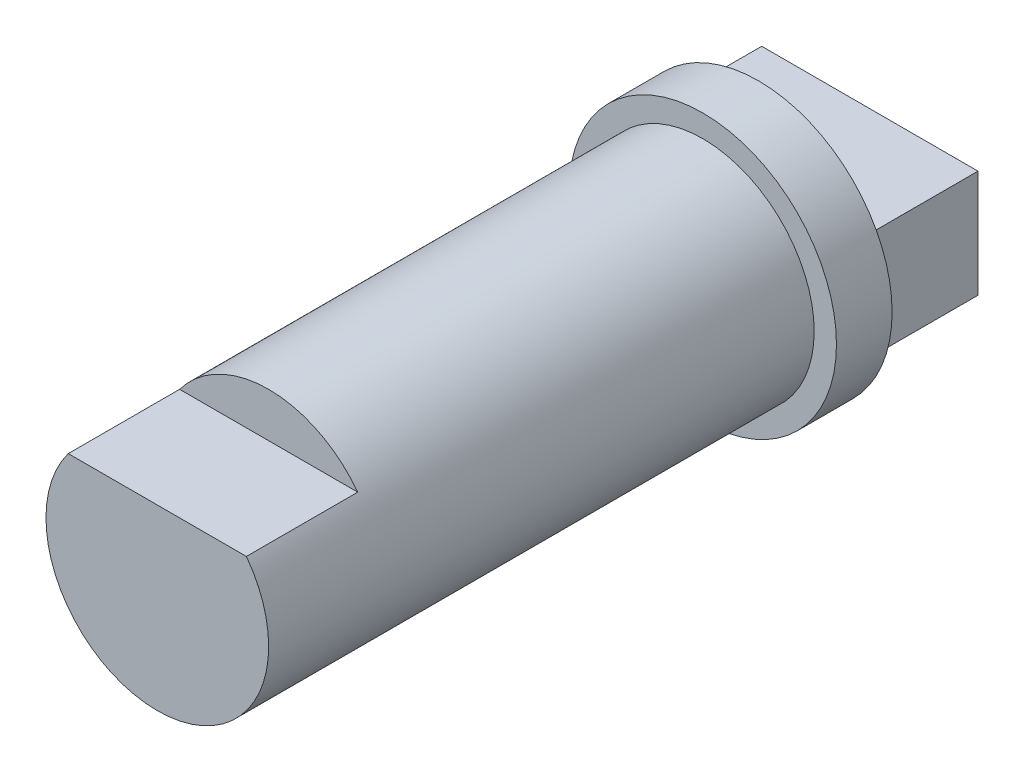
ISO-10303-21;
HEADER;
FILE_DESCRIPTION(('STEP AP214'),'2;1');
FILE_NAME('part.step','',(''),(''),'','','');
FILE_SCHEMA(('AUTOMOTIVE_DESIGN { 1 0 10303 214 1 1 1 1 }'));
ENDSEC;
DATA;
#1=APPLICATION_CONTEXT('core data for automotive mechanical design processes');
#2=APPLICATION_PROTOCOL_DEFINITION('international standard','automotive_design',2000,#1);
#3=PRODUCT_CONTEXT('',#1,'mechanical');
#4=PRODUCT('Part','Part','',(#3));
#5=PRODUCT_RELATED_PRODUCT_CATEGORY('part','',(#4));
#6=PRODUCT_DEFINITION_FORMATION('','',#4);
#7=PRODUCT_DEFINITION_CONTEXT('part definition',#1,'design');
#8=PRODUCT_DEFINITION('design','',#6,#7);
#9=PRODUCT_DEFINITION_SHAPE('','',#8);
#10=(LENGTH_UNIT() NAMED_UNIT(*) SI_UNIT(.MILLI.,.METRE.));
#11=(NAMED_UNIT(*) PLANE_ANGLE_UNIT() SI_UNIT($,.RADIAN.));
#12=(NAMED_UNIT(*) SI_UNIT($,.STERADIAN.) SOLID_ANGLE_UNIT());
#13=UNCERTAINTY_MEASURE_WITH_UNIT(LENGTH_MEASURE(1.E-05),#10,'distance_accuracy_value','');
#14=(GEOMETRIC_REPRESENTATION_CONTEXT(3) GLOBAL_UNCERTAINTY_ASSIGNED_CONTEXT((#13)) GLOBAL_UNIT_ASSIGNED_CONTEXT((#10,
#11,#12)) REPRESENTATION_CONTEXT('',''));
#15=CARTESIAN_POINT('',(0.,0.,0.));
#16=DIRECTION('',(0.,0.,1.));
#17=DIRECTION('',(1.,0.,0.));
#18=AXIS2_PLACEMENT_3D('',#15,#16,#17);
#19=CARTESIAN_POINT('',(0.,0.,49.));
#20=DIRECTION('',(0.,0.,-1.));
#21=DIRECTION('',(-1.,0.,0.));
#22=AXIS2_PLACEMENT_3D('',#19,#20,#21);
#23=CYLINDRICAL_SURFACE('',#22,10.);
#24=CARTESIAN_POINT('',(0.,0.,0.));
#25=DIRECTION('',(0.,0.,1.));
#26=DIRECTION('',(1.,0.,0.));
#27=AXIS2_PLACEMENT_3D('',#24,#25,#26);
#28=CIRCLE('',#27,10.);
#29=CARTESIAN_POINT('',(10.,0.,0.));
#30=VERTEX_POINT('',#29);
#31=EDGE_CURVE('E42',#30,#30,#28,.T.);
#32=ORIENTED_EDGE('',*,*,#31,.T.);
#33=EDGE_LOOP('',(#32));
#34=FACE_BOUND('',#33,.T.);
#35=DIRECTION('',(0.,0.,1.));
#36=VECTOR('',#35,1.);
#37=CARTESIAN_POINT('',(8.,6.,39.));
#38=LINE('',#37,#36);
#39=CARTESIAN_POINT('',(8.,6.,39.));
#40=VERTEX_POINT('',#39);
#41=CARTESIAN_POINT('',(8.,6.,49.));
#42=VERTEX_POINT('',#41);
#43=EDGE_CURVE('E131',#40,#42,#38,.T.);
#44=ORIENTED_EDGE('',*,*,#43,.T.);
#45=CARTESIAN_POINT('',(0.,0.,49.));
#46=DIRECTION('',(0.,0.,1.));
#47=DIRECTION('',(1.,0.,0.));
#48=AXIS2_PLACEMENT_3D('',#45,#46,#47);
#49=CIRCLE('',#48,10.);
#50=CARTESIAN_POINT('',(-8.,6.,49.));
#51=VERTEX_POINT('',#50);
#52=EDGE_CURVE('E11',#51,#42,#49,.T.);
#53=ORIENTED_EDGE('',*,*,#52,.F.);
#54=DIRECTION('',(0.,0.,1.));
#55=VECTOR('',#54,1.);
#56=CARTESIAN_POINT('',(-8.,6.,39.));
#57=LINE('',#56,#55);
#58=CARTESIAN_POINT('',(-8.,6.,39.));
#59=VERTEX_POINT('',#58);
#60=EDGE_CURVE('E133',#59,#51,#57,.T.);
#61=ORIENTED_EDGE('',*,*,#60,.F.);
#62=CARTESIAN_POINT('',(0.,0.,39.));
#63=DIRECTION('',(0.,0.,1.));
#64=DIRECTION('',(1.,0.,0.));
#65=AXIS2_PLACEMENT_3D('',#62,#63,#64);
#66=CIRCLE('',#65,10.);
#67=EDGE_CURVE('E128',#40,#59,#66,.T.);
#68=ORIENTED_EDGE('',*,*,#67,.F.);
#69=EDGE_LOOP('',(#44,#53,#61,#68));
#70=FACE_BOUND('',#69,.T.);
#71=ADVANCED_FACE('F39',(#34,#70),#23,.T.);
#72=CARTESIAN_POINT('',(0.,0.,49.));
#73=DIRECTION('',(0.,0.,1.));
#74=DIRECTION('',(1.,0.,0.));
#75=AXIS2_PLACEMENT_3D('',#72,#73,#74);
#76=PLANE('',#75);
#77=ORIENTED_EDGE('',*,*,#52,.T.);
#78=DIRECTION('',(-1.,0.,0.));
#79=VECTOR('',#78,1.);
#80=CARTESIAN_POINT('',(0.,6.,49.));
#81=LINE('',#80,#79);
#82=EDGE_CURVE('E115',#42,#51,#81,.T.);
#83=ORIENTED_EDGE('',*,*,#82,.T.);
#84=EDGE_LOOP('',(#77,#83));
#85=FACE_BOUND('',#84,.T.);
#86=ADVANCED_FACE('F167',(#85),#76,.T.);
#87=CARTESIAN_POINT('',(0.,0.,-5.));
#88=DIRECTION('',(0.,0.,1.));
#89=DIRECTION('',(1.,0.,0.));
#90=AXIS2_PLACEMENT_3D('',#87,#88,#89);
#91=CYLINDRICAL_SURFACE('',#90,12.);
#92=CARTESIAN_POINT('',(0.,0.,-5.));
#93=DIRECTION('',(0.,0.,-1.));
#94=DIRECTION('',(-1.,0.,0.));
#95=AXIS2_PLACEMENT_3D('',#92,#93,#94);
#96=CIRCLE('',#95,12.);
#97=CARTESIAN_POINT('',(-12.,0.,-5.));
#98=VERTEX_POINT('',#97);
#99=EDGE_CURVE('E140',#98,#98,#96,.T.);
#100=ORIENTED_EDGE('',*,*,#99,.F.);
#101=EDGE_LOOP('',(#100));
#102=FACE_BOUND('',#101,.T.);
#103=CARTESIAN_POINT('',(0.,0.,0.));
#104=DIRECTION('',(0.,0.,-1.));
#105=DIRECTION('',(-1.,0.,0.));
#106=AXIS2_PLACEMENT_3D('',#103,#104,#105);
#107=CIRCLE('',#106,12.);
#108=CARTESIAN_POINT('',(-12.,0.,0.));
#109=VERTEX_POINT('',#108);
#110=EDGE_CURVE('E136',#109,#109,#107,.T.);
#111=ORIENTED_EDGE('',*,*,#110,.T.);
#112=EDGE_LOOP('',(#111));
#113=FACE_BOUND('',#112,.T.);
#114=ADVANCED_FACE('F148',(#102,#113),#91,.T.);
#115=CARTESIAN_POINT('',(0.,0.,-5.));
#116=DIRECTION('',(0.,0.,-1.));
#117=DIRECTION('',(-1.,0.,0.));
#118=AXIS2_PLACEMENT_3D('',#115,#116,#117);
#119=PLANE('',#118);
#120=DIRECTION('',(0.,1.,0.));
#121=VECTOR('',#120,1.);
#122=CARTESIAN_POINT('',(-9.71428680432496,4.82765700989596,-5.));
#123=LINE('',#122,#121);
#124=CARTESIAN_POINT('',(-9.71428680432496,-4.82765700989596,-5.));
#125=VERTEX_POINT('',#124);
#126=CARTESIAN_POINT('',(-9.71428680432496,4.82765700989596,-5.));
#127=VERTEX_POINT('',#126);
#128=EDGE_CURVE('E54',#125,#127,#123,.T.);
#129=ORIENTED_EDGE('',*,*,#128,.F.);
#130=DIRECTION('',(-1.,0.,0.));
#131=VECTOR('',#130,1.);
#132=CARTESIAN_POINT('',(9.71428680432496,-4.82765700989596,-5.));
#133=LINE('',#132,#131);
#134=CARTESIAN_POINT('',(9.71428680432496,-4.82765700989596,-5.));
#135=VERTEX_POINT('',#134);
#136=EDGE_CURVE('E58',#135,#125,#133,.T.);
#137=ORIENTED_EDGE('',*,*,#136,.F.);
#138=DIRECTION('',(0.,-1.,0.));
#139=VECTOR('',#138,1.);
#140=CARTESIAN_POINT('',(9.71428680432496,4.82765700989596,-5.));
#141=LINE('',#140,#139);
#142=CARTESIAN_POINT('',(9.71428680432496,4.82765700989596,-5.));
#143=VERTEX_POINT('',#142);
#144=EDGE_CURVE('E272',#143,#135,#141,.T.);
#145=ORIENTED_EDGE('',*,*,#144,.F.);
#146=DIRECTION('',(1.,0.,0.));
#147=VECTOR('',#146,1.);
#148=CARTESIAN_POINT('',(9.71428680432496,4.82765700989596,-5.));
#149=LINE('',#148,#147);
#150=EDGE_CURVE('E282',#127,#143,#149,.T.);
#151=ORIENTED_EDGE('',*,*,#150,.F.);
#152=EDGE_LOOP('',(#129,#137,#145,#151));
#153=FACE_BOUND('',#152,.T.);
#154=ORIENTED_EDGE('',*,*,#99,.T.);
#155=EDGE_LOOP('',(#154));
#156=FACE_BOUND('',#155,.T.);
#157=ADVANCED_FACE('F153',(#153,#156),#119,.T.);
#158=CARTESIAN_POINT('',(0.,0.,0.));
#159=DIRECTION('',(0.,0.,-1.));
#160=DIRECTION('',(-1.,0.,0.));
#161=AXIS2_PLACEMENT_3D('',#158,#159,#160);
#162=PLANE('',#161);
#163=ORIENTED_EDGE('',*,*,#31,.F.);
#164=EDGE_LOOP('',(#163));
#165=FACE_BOUND('',#164,.T.);
#166=ORIENTED_EDGE('',*,*,#110,.F.);
#167=EDGE_LOOP('',(#166));
#168=FACE_BOUND('',#167,.T.);
#169=ADVANCED_FACE('F150',(#165,#168),#162,.F.);
#170=CARTESIAN_POINT('',(0.,6.,39.));
#171=DIRECTION('',(0.,1.,0.));
#172=DIRECTION('',(0.,0.,1.));
#173=AXIS2_PLACEMENT_3D('',#170,#171,#172);
#174=PLANE('',#173);
#175=ORIENTED_EDGE('',*,*,#82,.F.);
#176=ORIENTED_EDGE('',*,*,#43,.F.);
#177=DIRECTION('',(-1.,0.,0.));
#178=VECTOR('',#177,1.);
#179=CARTESIAN_POINT('',(0.,6.,39.));
#180=LINE('',#179,#178);
#181=EDGE_CURVE('E120',#40,#59,#180,.T.);
#182=ORIENTED_EDGE('',*,*,#181,.T.);
#183=ORIENTED_EDGE('',*,*,#60,.T.);
#184=EDGE_LOOP('',(#175,#176,#182,#183));
#185=FACE_BOUND('',#184,.T.);
#186=ADVANCED_FACE('F152',(#185),#174,.T.);
#187=CARTESIAN_POINT('',(0.,0.,39.));
#188=DIRECTION('',(0.,0.,1.));
#189=DIRECTION('',(1.,0.,0.));
#190=AXIS2_PLACEMENT_3D('',#187,#188,#189);
#191=PLANE('',#190);
#192=ORIENTED_EDGE('',*,*,#181,.F.);
#193=ORIENTED_EDGE('',*,*,#67,.T.);
#194=EDGE_LOOP('',(#192,#193));
#195=FACE_BOUND('',#194,.T.);
#196=ADVANCED_FACE('F160',(#195),#191,.T.);
#197=CARTESIAN_POINT('',(-9.71428680432496,4.82765700989596,-15.));
#198=DIRECTION('',(1.,0.,0.));
#199=DIRECTION('',(0.,0.,-1.));
#200=AXIS2_PLACEMENT_3D('',#197,#198,#199);
#201=PLANE('',#200);
#202=ORIENTED_EDGE('',*,*,#128,.T.);
#203=DIRECTION('',(0.,0.,1.));
#204=VECTOR('',#203,1.);
#205=CARTESIAN_POINT('',(-9.71428680432496,4.82765700989596,-15.));
#206=LINE('',#205,#204);
#207=CARTESIAN_POINT('',(-9.71428680432496,4.82765700989596,-15.));
#208=VERTEX_POINT('',#207);
#209=EDGE_CURVE('E95',#208,#127,#206,.T.);
#210=ORIENTED_EDGE('',*,*,#209,.F.);
#211=DIRECTION('',(0.,1.,0.));
#212=VECTOR('',#211,1.);
#213=CARTESIAN_POINT('',(-9.71428680432496,4.82765700989596,-15.));
#214=LINE('',#213,#212);
#215=CARTESIAN_POINT('',(-9.71428680432496,-4.82765700989596,-15.));
#216=VERTEX_POINT('',#215);
#217=EDGE_CURVE('E102',#216,#208,#214,.T.);
#218=ORIENTED_EDGE('',*,*,#217,.F.);
#219=DIRECTION('',(0.,0.,1.));
#220=VECTOR('',#219,1.);
#221=CARTESIAN_POINT('',(-9.71428680432496,-4.82765700989596,-15.));
#222=LINE('',#221,#220);
#223=EDGE_CURVE('E269',#216,#125,#222,.T.);
#224=ORIENTED_EDGE('',*,*,#223,.T.);
#225=EDGE_LOOP('',(#202,#210,#218,#224));
#226=FACE_BOUND('',#225,.T.);
#227=ADVANCED_FACE('F113',(#226),#201,.F.);
#228=CARTESIAN_POINT('',(9.71428680432496,4.82765700989596,-15.));
#229=DIRECTION('',(0.,-1.,0.));
#230=DIRECTION('',(0.,0.,-1.));
#231=AXIS2_PLACEMENT_3D('',#228,#229,#230);
#232=PLANE('',#231);
#233=ORIENTED_EDGE('',*,*,#150,.T.);
#234=DIRECTION('',(0.,0.,1.));
#235=VECTOR('',#234,1.);
#236=CARTESIAN_POINT('',(9.71428680432496,4.82765700989596,-15.));
#237=LINE('',#236,#235);
#238=CARTESIAN_POINT('',(9.71428680432496,4.82765700989596,-15.));
#239=VERTEX_POINT('',#238);
#240=EDGE_CURVE('E97',#239,#143,#237,.T.);
#241=ORIENTED_EDGE('',*,*,#240,.F.);
#242=DIRECTION('',(1.,0.,0.));
#243=VECTOR('',#242,1.);
#244=CARTESIAN_POINT('',(9.71428680432496,4.82765700989596,-15.));
#245=LINE('',#244,#243);
#246=EDGE_CURVE('E90',#208,#239,#245,.T.);
#247=ORIENTED_EDGE('',*,*,#246,.F.);
#248=ORIENTED_EDGE('',*,*,#209,.T.);
#249=EDGE_LOOP('',(#233,#241,#247,#248));
#250=FACE_BOUND('',#249,.T.);
#251=ADVANCED_FACE('F93',(#250),#232,.F.);
#252=CARTESIAN_POINT('',(9.71428680432496,4.82765700989596,-15.));
#253=DIRECTION('',(-1.,0.,0.));
#254=DIRECTION('',(0.,0.,1.));
#255=AXIS2_PLACEMENT_3D('',#252,#253,#254);
#256=PLANE('',#255);
#257=ORIENTED_EDGE('',*,*,#144,.T.);
#258=DIRECTION('',(0.,0.,1.));
#259=VECTOR('',#258,1.);
#260=CARTESIAN_POINT('',(9.71428680432496,-4.82765700989596,-15.));
#261=LINE('',#260,#259);
#262=CARTESIAN_POINT('',(9.71428680432496,-4.82765700989596,-15.));
#263=VERTEX_POINT('',#262);
#264=EDGE_CURVE('E122',#263,#135,#261,.T.);
#265=ORIENTED_EDGE('',*,*,#264,.F.);
#266=DIRECTION('',(0.,-1.,0.));
#267=VECTOR('',#266,1.);
#268=CARTESIAN_POINT('',(9.71428680432496,4.82765700989596,-15.));
#269=LINE('',#268,#267);
#270=EDGE_CURVE('E101',#239,#263,#269,.T.);
#271=ORIENTED_EDGE('',*,*,#270,.F.);
#272=ORIENTED_EDGE('',*,*,#240,.T.);
#273=EDGE_LOOP('',(#257,#265,#271,#272));
#274=FACE_BOUND('',#273,.T.);
#275=ADVANCED_FACE('F189',(#274),#256,.F.);
#276=CARTESIAN_POINT('',(9.71428680432496,-4.82765700989596,-15.));
#277=DIRECTION('',(0.,1.,0.));
#278=DIRECTION('',(0.,0.,1.));
#279=AXIS2_PLACEMENT_3D('',#276,#277,#278);
#280=PLANE('',#279);
#281=ORIENTED_EDGE('',*,*,#136,.T.);
#282=ORIENTED_EDGE('',*,*,#223,.F.);
#283=DIRECTION('',(-1.,0.,0.));
#284=VECTOR('',#283,1.);
#285=CARTESIAN_POINT('',(9.71428680432496,-4.82765700989596,-15.));
#286=LINE('',#285,#284);
#287=EDGE_CURVE('E107',#263,#216,#286,.T.);
#288=ORIENTED_EDGE('',*,*,#287,.F.);
#289=ORIENTED_EDGE('',*,*,#264,.T.);
#290=EDGE_LOOP('',(#281,#282,#288,#289));
#291=FACE_BOUND('',#290,.T.);
#292=ADVANCED_FACE('F192',(#291),#280,.F.);
#293=CARTESIAN_POINT('',(0.,0.,-15.));
#294=DIRECTION('',(0.,0.,-1.));
#295=DIRECTION('',(-1.,0.,0.));
#296=AXIS2_PLACEMENT_3D('',#293,#294,#295);
#297=PLANE('',#296);
#298=ORIENTED_EDGE('',*,*,#217,.T.);
#299=ORIENTED_EDGE('',*,*,#246,.T.);
#300=ORIENTED_EDGE('',*,*,#270,.T.);
#301=ORIENTED_EDGE('',*,*,#287,.T.);
#302=EDGE_LOOP('',(#298,#299,#300,#301));
#303=FACE_BOUND('',#302,.T.);
#304=ADVANCED_FACE('F105',(#303),#297,.T.);
#305=CLOSED_SHELL('',(#71,#86,#114,#157,#169,#186,#196,#227,#251,#275,#292,#304));
#306=MANIFOLD_SOLID_BREP('B2',#305);
#307=ADVANCED_BREP_SHAPE_REPRESENTATION('',(#18,#306),#14);
#308=SHAPE_DEFINITION_REPRESENTATION(#9,#307);
ENDSEC;
END-ISO-10303-21;
